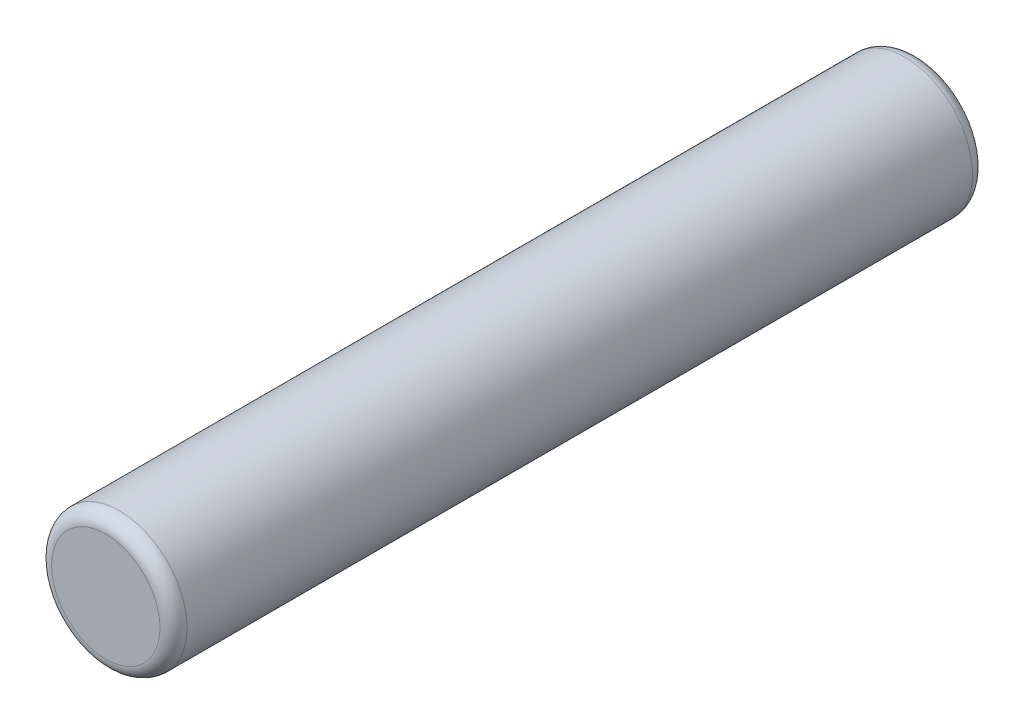
ISO-10303-21;
HEADER;
FILE_DESCRIPTION(('STEP AP214'),'2;1');
FILE_NAME('part.step','',(''),(''),'','','');
FILE_SCHEMA(('AUTOMOTIVE_DESIGN { 1 0 10303 214 1 1 1 1 }'));
ENDSEC;
DATA;
#1=APPLICATION_CONTEXT('core data for automotive mechanical design processes');
#2=APPLICATION_PROTOCOL_DEFINITION('international standard','automotive_design',2000,#1);
#3=PRODUCT_CONTEXT('',#1,'mechanical');
#4=PRODUCT('Part','Part','',(#3));
#5=PRODUCT_RELATED_PRODUCT_CATEGORY('part','',(#4));
#6=PRODUCT_DEFINITION_FORMATION('','',#4);
#7=PRODUCT_DEFINITION_CONTEXT('part definition',#1,'design');
#8=PRODUCT_DEFINITION('design','',#6,#7);
#9=PRODUCT_DEFINITION_SHAPE('','',#8);
#10=(LENGTH_UNIT() NAMED_UNIT(*) SI_UNIT(.MILLI.,.METRE.));
#11=(NAMED_UNIT(*) PLANE_ANGLE_UNIT() SI_UNIT($,.RADIAN.));
#12=(NAMED_UNIT(*) SI_UNIT($,.STERADIAN.) SOLID_ANGLE_UNIT());
#13=UNCERTAINTY_MEASURE_WITH_UNIT(LENGTH_MEASURE(1.E-05),#10,'distance_accuracy_value','');
#14=(GEOMETRIC_REPRESENTATION_CONTEXT(3) GLOBAL_UNCERTAINTY_ASSIGNED_CONTEXT((#13)) GLOBAL_UNIT_ASSIGNED_CONTEXT((#10,
#11,#12)) REPRESENTATION_CONTEXT('',''));
#15=CARTESIAN_POINT('',(0.,0.,0.));
#16=DIRECTION('',(0.,0.,1.));
#17=DIRECTION('',(1.,0.,0.));
#18=AXIS2_PLACEMENT_3D('',#15,#16,#17);
#19=CARTESIAN_POINT('',(1.90211303259042,0.618033988750047,3.));
#20=DIRECTION('',(0.,0.,1.));
#21=DIRECTION('',(1.,0.,0.));
#22=AXIS2_PLACEMENT_3D('',#19,#20,#21);
#23=PLANE('',#22);
#24=CARTESIAN_POINT('',(1.90211303259042,0.618033988750047,3.));
#25=DIRECTION('',(0.,0.,-1.));
#26=DIRECTION('',(-1.,0.,0.));
#27=AXIS2_PLACEMENT_3D('',#24,#25,#26);
#28=CIRCLE('',#27,0.4);
#29=CARTESIAN_POINT('',(1.50211303259042,0.618033988750047,3.));
#30=VERTEX_POINT('',#29);
#31=EDGE_CURVE('E62',#30,#30,#28,.T.);
#32=ORIENTED_EDGE('',*,*,#31,.F.);
#33=EDGE_LOOP('',(#32));
#34=FACE_BOUND('',#33,.T.);
#35=ADVANCED_FACE('F15',(#34),#23,.T.);
#36=CARTESIAN_POINT('',(1.90211303259042,0.618033988750047,-3.));
#37=DIRECTION('',(0.,0.,1.));
#38=DIRECTION('',(1.,0.,0.));
#39=AXIS2_PLACEMENT_3D('',#36,#37,#38);
#40=PLANE('',#39);
#41=CARTESIAN_POINT('',(1.90211303259042,0.618033988750047,-3.));
#42=DIRECTION('',(0.,0.,1.));
#43=DIRECTION('',(-1.,0.,0.));
#44=AXIS2_PLACEMENT_3D('',#41,#42,#43);
#45=CIRCLE('',#44,0.4);
#46=CARTESIAN_POINT('',(1.50211303259042,0.618033988750047,-3.));
#47=VERTEX_POINT('',#46);
#48=EDGE_CURVE('E30',#47,#47,#45,.T.);
#49=ORIENTED_EDGE('',*,*,#48,.F.);
#50=EDGE_LOOP('',(#49));
#51=FACE_BOUND('',#50,.T.);
#52=ADVANCED_FACE('F75',(#51),#40,.F.);
#53=CARTESIAN_POINT('',(1.90211303259042,0.618033988750047,2.9));
#54=DIRECTION('',(0.,0.,-1.));
#55=DIRECTION('',(1.,0.,0.));
#56=AXIS2_PLACEMENT_3D('',#53,#54,#55);
#57=TOROIDAL_SURFACE('',#56,0.4,0.1);
#58=ORIENTED_EDGE('',*,*,#31,.T.);
#59=EDGE_LOOP('',(#58));
#60=FACE_BOUND('',#59,.T.);
#61=CARTESIAN_POINT('',(1.90211303259042,0.618033988750047,2.9));
#62=DIRECTION('',(0.,0.,-1.));
#63=DIRECTION('',(-1.,0.,0.));
#64=AXIS2_PLACEMENT_3D('',#61,#62,#63);
#65=CIRCLE('',#64,0.5);
#66=CARTESIAN_POINT('',(1.40211303259042,0.618033988750047,2.9));
#67=VERTEX_POINT('',#66);
#68=EDGE_CURVE('E25',#67,#67,#65,.T.);
#69=ORIENTED_EDGE('',*,*,#68,.F.);
#70=EDGE_LOOP('',(#69));
#71=FACE_BOUND('',#70,.T.);
#72=ADVANCED_FACE('F43',(#60,#71),#57,.T.);
#73=CARTESIAN_POINT('',(1.90211303259042,0.618033988750047,-2.9));
#74=DIRECTION('',(0.,0.,-1.));
#75=DIRECTION('',(1.,0.,0.));
#76=AXIS2_PLACEMENT_3D('',#73,#74,#75);
#77=TOROIDAL_SURFACE('',#76,0.4,0.1);
#78=CARTESIAN_POINT('',(1.90211303259042,0.618033988750047,-2.9));
#79=DIRECTION('',(0.,0.,-1.));
#80=DIRECTION('',(-1.,0.,0.));
#81=AXIS2_PLACEMENT_3D('',#78,#79,#80);
#82=CIRCLE('',#81,0.5);
#83=CARTESIAN_POINT('',(1.40211303259042,0.618033988750047,-2.9));
#84=VERTEX_POINT('',#83);
#85=EDGE_CURVE('E10',#84,#84,#82,.F.);
#86=ORIENTED_EDGE('',*,*,#85,.F.);
#87=EDGE_LOOP('',(#86));
#88=FACE_BOUND('',#87,.T.);
#89=ORIENTED_EDGE('',*,*,#48,.T.);
#90=EDGE_LOOP('',(#89));
#91=FACE_BOUND('',#90,.T.);
#92=ADVANCED_FACE('F38',(#88,#91),#77,.T.);
#93=CARTESIAN_POINT('',(1.90211303259042,0.618033988750047,-3.));
#94=DIRECTION('',(0.,0.,-1.));
#95=DIRECTION('',(-1.,0.,0.));
#96=AXIS2_PLACEMENT_3D('',#93,#94,#95);
#97=CYLINDRICAL_SURFACE('',#96,0.5);
#98=ORIENTED_EDGE('',*,*,#85,.T.);
#99=EDGE_LOOP('',(#98));
#100=FACE_BOUND('',#99,.T.);
#101=ORIENTED_EDGE('',*,*,#68,.T.);
#102=EDGE_LOOP('',(#101));
#103=FACE_BOUND('',#102,.T.);
#104=ADVANCED_FACE('F42',(#100,#103),#97,.T.);
#105=CLOSED_SHELL('',(#35,#52,#72,#92,#104));
#106=MANIFOLD_SOLID_BREP('B1',#105);
#107=ADVANCED_BREP_SHAPE_REPRESENTATION('',(#18,#106),#14);
#108=SHAPE_DEFINITION_REPRESENTATION(#9,#107);
ENDSEC;
END-ISO-10303-21;
